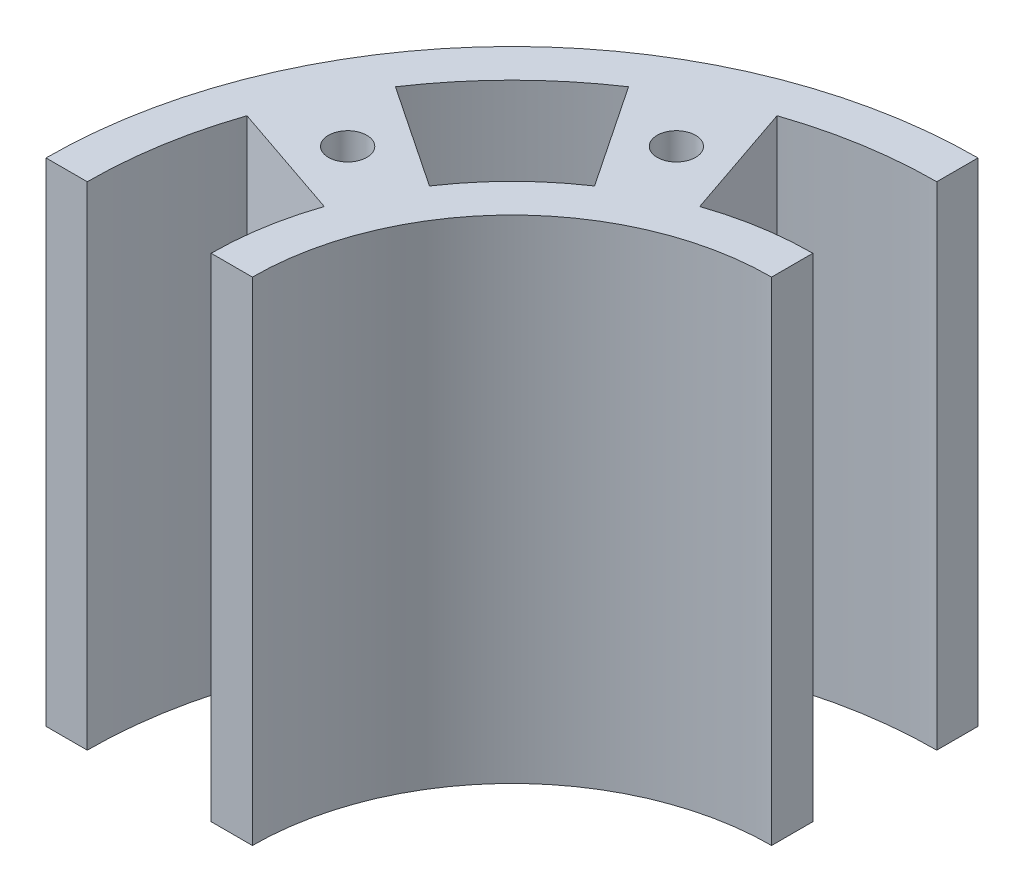
ISO-10303-21;
HEADER;
FILE_DESCRIPTION(('STEP AP214'),'2;1');
FILE_NAME('part.step','',(''),(''),'','','');
FILE_SCHEMA(('AUTOMOTIVE_DESIGN { 1 0 10303 214 1 1 1 1 }'));
ENDSEC;
DATA;
#1=APPLICATION_CONTEXT('core data for automotive mechanical design processes');
#2=APPLICATION_PROTOCOL_DEFINITION('international standard','automotive_design',2000,#1);
#3=PRODUCT_CONTEXT('',#1,'mechanical');
#4=PRODUCT('Part','Part','',(#3));
#5=PRODUCT_RELATED_PRODUCT_CATEGORY('part','',(#4));
#6=PRODUCT_DEFINITION_FORMATION('','',#4);
#7=PRODUCT_DEFINITION_CONTEXT('part definition',#1,'design');
#8=PRODUCT_DEFINITION('design','',#6,#7);
#9=PRODUCT_DEFINITION_SHAPE('','',#8);
#10=(LENGTH_UNIT() NAMED_UNIT(*) SI_UNIT(.MILLI.,.METRE.));
#11=(NAMED_UNIT(*) PLANE_ANGLE_UNIT() SI_UNIT($,.RADIAN.));
#12=(NAMED_UNIT(*) SI_UNIT($,.STERADIAN.) SOLID_ANGLE_UNIT());
#13=UNCERTAINTY_MEASURE_WITH_UNIT(LENGTH_MEASURE(1.E-05),#10,'distance_accuracy_value','');
#14=(GEOMETRIC_REPRESENTATION_CONTEXT(3) GLOBAL_UNCERTAINTY_ASSIGNED_CONTEXT((#13)) GLOBAL_UNIT_ASSIGNED_CONTEXT((#10,
#11,#12)) REPRESENTATION_CONTEXT('',''));
#15=CARTESIAN_POINT('',(0.,0.,0.));
#16=DIRECTION('',(0.,0.,1.));
#17=DIRECTION('',(1.,0.,0.));
#18=AXIS2_PLACEMENT_3D('',#15,#16,#17);
#19=CARTESIAN_POINT('',(60.,46.8,60.));
#20=DIRECTION('',(0.,-1.,0.));
#21=DIRECTION('',(0.,0.,-1.));
#22=AXIS2_PLACEMENT_3D('',#19,#20,#21);
#23=CYLINDRICAL_SURFACE('',#22,24.68);
#24=CARTESIAN_POINT('',(60.,0.,60.));
#25=DIRECTION('',(0.,1.,0.));
#26=DIRECTION('',(0.,0.,1.));
#27=AXIS2_PLACEMENT_3D('',#24,#25,#26);
#28=CIRCLE('',#27,24.68);
#29=CARTESIAN_POINT('',(60.,0.,35.32));
#30=VERTEX_POINT('',#29);
#31=CARTESIAN_POINT('',(35.32,0.,60.));
#32=VERTEX_POINT('',#31);
#33=EDGE_CURVE('E205',#30,#32,#28,.T.);
#34=ORIENTED_EDGE('',*,*,#33,.F.);
#35=DIRECTION('',(0.,-1.,0.));
#36=VECTOR('',#35,1.);
#37=CARTESIAN_POINT('',(60.,46.8,35.32));
#38=LINE('',#37,#36);
#39=CARTESIAN_POINT('',(60.,46.8,35.32));
#40=VERTEX_POINT('',#39);
#41=EDGE_CURVE('E11',#40,#30,#38,.T.);
#42=ORIENTED_EDGE('',*,*,#41,.F.);
#43=CARTESIAN_POINT('',(60.,46.8,60.));
#44=DIRECTION('',(0.,1.,0.));
#45=DIRECTION('',(0.,0.,1.));
#46=AXIS2_PLACEMENT_3D('',#43,#44,#45);
#47=CIRCLE('',#46,24.68);
#48=CARTESIAN_POINT('',(35.32,46.8,60.));
#49=VERTEX_POINT('',#48);
#50=EDGE_CURVE('E359',#40,#49,#47,.T.);
#51=ORIENTED_EDGE('',*,*,#50,.T.);
#52=DIRECTION('',(0.,-1.,0.));
#53=VECTOR('',#52,1.);
#54=CARTESIAN_POINT('',(35.32,46.8,60.));
#55=LINE('',#54,#53);
#56=EDGE_CURVE('E113',#49,#32,#55,.T.);
#57=ORIENTED_EDGE('',*,*,#56,.T.);
#58=EDGE_LOOP('',(#34,#42,#51,#57));
#59=FACE_BOUND('',#58,.T.);
#60=ADVANCED_FACE('F35',(#59),#23,.F.);
#61=CARTESIAN_POINT('',(60.,46.8,0.));
#62=DIRECTION('',(1.,0.,0.));
#63=DIRECTION('',(0.,0.,-1.));
#64=AXIS2_PLACEMENT_3D('',#61,#62,#63);
#65=PLANE('',#64);
#66=DIRECTION('',(0.,0.,1.));
#67=VECTOR('',#66,1.);
#68=CARTESIAN_POINT('',(60.,0.,0.));
#69=LINE('',#68,#67);
#70=CARTESIAN_POINT('',(60.,0.,31.4));
#71=VERTEX_POINT('',#70);
#72=EDGE_CURVE('E207',#71,#30,#69,.T.);
#73=ORIENTED_EDGE('',*,*,#72,.F.);
#74=DIRECTION('',(0.,-1.,0.));
#75=VECTOR('',#74,1.);
#76=CARTESIAN_POINT('',(60.,46.8,31.4));
#77=LINE('',#76,#75);
#78=CARTESIAN_POINT('',(60.,46.8,31.4));
#79=VERTEX_POINT('',#78);
#80=EDGE_CURVE('E45',#79,#71,#77,.T.);
#81=ORIENTED_EDGE('',*,*,#80,.F.);
#82=DIRECTION('',(0.,0.,1.));
#83=VECTOR('',#82,1.);
#84=CARTESIAN_POINT('',(60.,46.8,0.));
#85=LINE('',#84,#83);
#86=EDGE_CURVE('E358',#79,#40,#85,.T.);
#87=ORIENTED_EDGE('',*,*,#86,.T.);
#88=ORIENTED_EDGE('',*,*,#41,.T.);
#89=EDGE_LOOP('',(#73,#81,#87,#88));
#90=FACE_BOUND('',#89,.T.);
#91=ADVANCED_FACE('F293',(#90),#65,.T.);
#92=CARTESIAN_POINT('',(60.,46.8,60.));
#93=DIRECTION('',(0.,-1.,0.));
#94=DIRECTION('',(0.,0.,-1.));
#95=AXIS2_PLACEMENT_3D('',#92,#93,#94);
#96=CYLINDRICAL_SURFACE('',#95,28.6);
#97=CARTESIAN_POINT('',(60.,0.,60.));
#98=DIRECTION('',(0.,1.,0.));
#99=DIRECTION('',(0.,0.,1.));
#100=AXIS2_PLACEMENT_3D('',#97,#98,#99);
#101=CIRCLE('',#100,28.6);
#102=CARTESIAN_POINT('',(50.7743170530492,0.,32.9288571692597));
#103=VERTEX_POINT('',#102);
#104=EDGE_CURVE('E210',#71,#103,#101,.T.);
#105=ORIENTED_EDGE('',*,*,#104,.T.);
#106=DIRECTION('',(0.,-1.,0.));
#107=VECTOR('',#106,1.);
#108=CARTESIAN_POINT('',(50.7743170530492,46.8,32.9288571692597));
#109=LINE('',#108,#107);
#110=CARTESIAN_POINT('',(50.7743170530492,46.8,32.9288571692597));
#111=VERTEX_POINT('',#110);
#112=EDGE_CURVE('E253',#111,#103,#109,.T.);
#113=ORIENTED_EDGE('',*,*,#112,.F.);
#114=CARTESIAN_POINT('',(60.,46.8,60.));
#115=DIRECTION('',(0.,1.,0.));
#116=DIRECTION('',(0.,0.,1.));
#117=AXIS2_PLACEMENT_3D('',#114,#115,#116);
#118=CIRCLE('',#117,28.6);
#119=EDGE_CURVE('E363',#79,#111,#118,.T.);
#120=ORIENTED_EDGE('',*,*,#119,.F.);
#121=ORIENTED_EDGE('',*,*,#80,.T.);
#122=EDGE_LOOP('',(#105,#113,#120,#121));
#123=FACE_BOUND('',#122,.T.);
#124=ADVANCED_FACE('F298',(#123),#96,.T.);
#125=CARTESIAN_POINT('',(35.4367201374867,46.8,-12.0766214678252));
#126=DIRECTION('',(-0.946543455620289,0.,0.322576326816463));
#127=DIRECTION('',(0.322576326816463,0.,0.946543455620289));
#128=AXIS2_PLACEMENT_3D('',#125,#126,#127);
#129=PLANE('',#128);
#130=DIRECTION('',(-0.322576326816463,0.,-0.946543455620289));
#131=VECTOR('',#130,1.);
#132=CARTESIAN_POINT('',(35.4367201374867,0.,-12.0766214678252));
#133=LINE('',#132,#131);
#134=CARTESIAN_POINT('',(46.9743679231513,0.,21.7785752620527));
#135=VERTEX_POINT('',#134);
#136=EDGE_CURVE('E213',#103,#135,#133,.T.);
#137=ORIENTED_EDGE('',*,*,#136,.T.);
#138=DIRECTION('',(0.,-1.,0.));
#139=VECTOR('',#138,1.);
#140=CARTESIAN_POINT('',(46.9743679231513,46.8,21.7785752620527));
#141=LINE('',#140,#139);
#142=CARTESIAN_POINT('',(46.9743679231513,46.8,21.7785752620527));
#143=VERTEX_POINT('',#142);
#144=EDGE_CURVE('E251',#143,#135,#141,.T.);
#145=ORIENTED_EDGE('',*,*,#144,.F.);
#146=DIRECTION('',(-0.322576326816463,0.,-0.946543455620289));
#147=VECTOR('',#146,1.);
#148=CARTESIAN_POINT('',(35.4367201374867,46.8,-12.0766214678252));
#149=LINE('',#148,#147);
#150=EDGE_CURVE('E370',#111,#143,#149,.T.);
#151=ORIENTED_EDGE('',*,*,#150,.F.);
#152=ORIENTED_EDGE('',*,*,#112,.T.);
#153=EDGE_LOOP('',(#137,#145,#151,#152));
#154=FACE_BOUND('',#153,.T.);
#155=ADVANCED_FACE('F343',(#154),#129,.F.);
#156=CARTESIAN_POINT('',(60.,46.8,60.));
#157=DIRECTION('',(0.,-1.,0.));
#158=DIRECTION('',(0.,0.,-1.));
#159=AXIS2_PLACEMENT_3D('',#156,#157,#158);
#160=CYLINDRICAL_SURFACE('',#159,40.38);
#161=CARTESIAN_POINT('',(60.,0.,60.));
#162=DIRECTION('',(0.,1.,0.));
#163=DIRECTION('',(0.,0.,1.));
#164=AXIS2_PLACEMENT_3D('',#161,#162,#163);
#165=CIRCLE('',#164,40.38);
#166=CARTESIAN_POINT('',(60.,0.,19.62));
#167=VERTEX_POINT('',#166);
#168=EDGE_CURVE('E216',#167,#135,#165,.T.);
#169=ORIENTED_EDGE('',*,*,#168,.F.);
#170=DIRECTION('',(0.,-1.,0.));
#171=VECTOR('',#170,1.);
#172=CARTESIAN_POINT('',(60.,46.8,19.62));
#173=LINE('',#172,#171);
#174=CARTESIAN_POINT('',(60.,46.8,19.62));
#175=VERTEX_POINT('',#174);
#176=EDGE_CURVE('E249',#175,#167,#173,.T.);
#177=ORIENTED_EDGE('',*,*,#176,.F.);
#178=CARTESIAN_POINT('',(60.,46.8,60.));
#179=DIRECTION('',(0.,1.,0.));
#180=DIRECTION('',(0.,0.,1.));
#181=AXIS2_PLACEMENT_3D('',#178,#179,#180);
#182=CIRCLE('',#181,40.38);
#183=EDGE_CURVE('E372',#175,#143,#182,.T.);
#184=ORIENTED_EDGE('',*,*,#183,.T.);
#185=ORIENTED_EDGE('',*,*,#144,.T.);
#186=EDGE_LOOP('',(#169,#177,#184,#185));
#187=FACE_BOUND('',#186,.T.);
#188=ADVANCED_FACE('F339',(#187),#160,.F.);
#189=CARTESIAN_POINT('',(60.,46.8,0.));
#190=DIRECTION('',(1.,0.,0.));
#191=DIRECTION('',(0.,0.,-1.));
#192=AXIS2_PLACEMENT_3D('',#189,#190,#191);
#193=PLANE('',#192);
#194=DIRECTION('',(0.,0.,1.));
#195=VECTOR('',#194,1.);
#196=CARTESIAN_POINT('',(60.,0.,0.));
#197=LINE('',#196,#195);
#198=CARTESIAN_POINT('',(60.,0.,15.7));
#199=VERTEX_POINT('',#198);
#200=EDGE_CURVE('E219',#199,#167,#197,.T.);
#201=ORIENTED_EDGE('',*,*,#200,.F.);
#202=DIRECTION('',(0.,-1.,0.));
#203=VECTOR('',#202,1.);
#204=CARTESIAN_POINT('',(60.,46.8,15.7));
#205=LINE('',#204,#203);
#206=CARTESIAN_POINT('',(60.,46.8,15.7));
#207=VERTEX_POINT('',#206);
#208=EDGE_CURVE('E247',#207,#199,#205,.T.);
#209=ORIENTED_EDGE('',*,*,#208,.F.);
#210=DIRECTION('',(0.,0.,1.));
#211=VECTOR('',#210,1.);
#212=CARTESIAN_POINT('',(60.,46.8,0.));
#213=LINE('',#212,#211);
#214=EDGE_CURVE('E375',#207,#175,#213,.T.);
#215=ORIENTED_EDGE('',*,*,#214,.T.);
#216=ORIENTED_EDGE('',*,*,#176,.T.);
#217=EDGE_LOOP('',(#201,#209,#215,#216));
#218=FACE_BOUND('',#217,.T.);
#219=ADVANCED_FACE('F335',(#218),#193,.T.);
#220=CARTESIAN_POINT('',(60.,46.8,60.));
#221=DIRECTION('',(0.,-1.,0.));
#222=DIRECTION('',(0.,0.,-1.));
#223=AXIS2_PLACEMENT_3D('',#220,#221,#222);
#224=CYLINDRICAL_SURFACE('',#223,44.3);
#225=CARTESIAN_POINT('',(60.,0.,60.));
#226=DIRECTION('',(0.,1.,0.));
#227=DIRECTION('',(0.,0.,1.));
#228=AXIS2_PLACEMENT_3D('',#225,#226,#227);
#229=CIRCLE('',#228,44.3);
#230=CARTESIAN_POINT('',(15.7,0.,60.));
#231=VERTEX_POINT('',#230);
#232=EDGE_CURVE('E222',#199,#231,#229,.T.);
#233=ORIENTED_EDGE('',*,*,#232,.T.);
#234=DIRECTION('',(0.,-1.,0.));
#235=VECTOR('',#234,1.);
#236=CARTESIAN_POINT('',(15.7,46.8,60.));
#237=LINE('',#236,#235);
#238=CARTESIAN_POINT('',(15.7,46.8,60.));
#239=VERTEX_POINT('',#238);
#240=EDGE_CURVE('E244',#239,#231,#237,.T.);
#241=ORIENTED_EDGE('',*,*,#240,.F.);
#242=CARTESIAN_POINT('',(60.,46.8,60.));
#243=DIRECTION('',(0.,1.,0.));
#244=DIRECTION('',(0.,0.,1.));
#245=AXIS2_PLACEMENT_3D('',#242,#243,#244);
#246=CIRCLE('',#245,44.3);
#247=EDGE_CURVE('E378',#207,#239,#246,.T.);
#248=ORIENTED_EDGE('',*,*,#247,.F.);
#249=ORIENTED_EDGE('',*,*,#208,.T.);
#250=EDGE_LOOP('',(#233,#241,#248,#249));
#251=FACE_BOUND('',#250,.T.);
#252=ADVANCED_FACE('F331',(#251),#224,.T.);
#253=CARTESIAN_POINT('',(0.,46.8,60.));
#254=DIRECTION('',(0.,0.,-1.));
#255=DIRECTION('',(-1.,0.,0.));
#256=AXIS2_PLACEMENT_3D('',#253,#254,#255);
#257=PLANE('',#256);
#258=DIRECTION('',(1.,0.,0.));
#259=VECTOR('',#258,1.);
#260=CARTESIAN_POINT('',(0.,0.,60.));
#261=LINE('',#260,#259);
#262=CARTESIAN_POINT('',(19.62,0.,60.));
#263=VERTEX_POINT('',#262);
#264=EDGE_CURVE('E225',#231,#263,#261,.T.);
#265=ORIENTED_EDGE('',*,*,#264,.T.);
#266=DIRECTION('',(0.,-1.,0.));
#267=VECTOR('',#266,1.);
#268=CARTESIAN_POINT('',(19.62,46.8,60.));
#269=LINE('',#268,#267);
#270=CARTESIAN_POINT('',(19.62,46.8,60.));
#271=VERTEX_POINT('',#270);
#272=EDGE_CURVE('E242',#271,#263,#269,.T.);
#273=ORIENTED_EDGE('',*,*,#272,.F.);
#274=DIRECTION('',(1.,0.,0.));
#275=VECTOR('',#274,1.);
#276=CARTESIAN_POINT('',(0.,46.8,60.));
#277=LINE('',#276,#275);
#278=EDGE_CURVE('E182',#239,#271,#277,.T.);
#279=ORIENTED_EDGE('',*,*,#278,.F.);
#280=ORIENTED_EDGE('',*,*,#240,.T.);
#281=EDGE_LOOP('',(#265,#273,#279,#280));
#282=FACE_BOUND('',#281,.T.);
#283=ADVANCED_FACE('F327',(#282),#257,.F.);
#284=CARTESIAN_POINT('',(60.,46.8,60.));
#285=DIRECTION('',(0.,-1.,0.));
#286=DIRECTION('',(0.,0.,-1.));
#287=AXIS2_PLACEMENT_3D('',#284,#285,#286);
#288=CYLINDRICAL_SURFACE('',#287,40.38);
#289=CARTESIAN_POINT('',(60.,0.,60.));
#290=DIRECTION('',(0.,1.,0.));
#291=DIRECTION('',(0.,0.,1.));
#292=AXIS2_PLACEMENT_3D('',#289,#290,#291);
#293=CIRCLE('',#292,40.38);
#294=CARTESIAN_POINT('',(21.7785752620527,0.,46.9743679231513));
#295=VERTEX_POINT('',#294);
#296=EDGE_CURVE('E228',#295,#263,#293,.T.);
#297=ORIENTED_EDGE('',*,*,#296,.F.);
#298=DIRECTION('',(0.,-1.,0.));
#299=VECTOR('',#298,1.);
#300=CARTESIAN_POINT('',(21.7785752620527,46.8,46.9743679231513));
#301=LINE('',#300,#299);
#302=CARTESIAN_POINT('',(21.7785752620527,46.8,46.9743679231513));
#303=VERTEX_POINT('',#302);
#304=EDGE_CURVE('E169',#303,#295,#301,.T.);
#305=ORIENTED_EDGE('',*,*,#304,.F.);
#306=CARTESIAN_POINT('',(60.,46.8,60.));
#307=DIRECTION('',(0.,1.,0.));
#308=DIRECTION('',(0.,0.,1.));
#309=AXIS2_PLACEMENT_3D('',#306,#307,#308);
#310=CIRCLE('',#309,40.38);
#311=EDGE_CURVE('E180',#303,#271,#310,.T.);
#312=ORIENTED_EDGE('',*,*,#311,.T.);
#313=ORIENTED_EDGE('',*,*,#272,.T.);
#314=EDGE_LOOP('',(#297,#305,#312,#313));
#315=FACE_BOUND('',#314,.T.);
#316=ADVANCED_FACE('F324',(#315),#288,.F.);
#317=CARTESIAN_POINT('',(-12.0766214678252,46.8,35.4367201374867));
#318=DIRECTION('',(-0.322576326816462,0.,0.94654345562029));
#319=DIRECTION('',(0.94654345562029,0.,0.322576326816462));
#320=AXIS2_PLACEMENT_3D('',#317,#318,#319);
#321=PLANE('',#320);
#322=DIRECTION('',(-0.94654345562029,0.,-0.322576326816462));
#323=VECTOR('',#322,1.);
#324=CARTESIAN_POINT('',(-12.0766214678252,0.,35.4367201374867));
#325=LINE('',#324,#323);
#326=CARTESIAN_POINT('',(32.9288571692597,0.,50.7743170530492));
#327=VERTEX_POINT('',#326);
#328=EDGE_CURVE('E166',#327,#295,#325,.T.);
#329=ORIENTED_EDGE('',*,*,#328,.F.);
#330=DIRECTION('',(0.,-1.,0.));
#331=VECTOR('',#330,1.);
#332=CARTESIAN_POINT('',(32.9288571692597,46.8,50.7743170530492));
#333=LINE('',#332,#331);
#334=CARTESIAN_POINT('',(32.9288571692597,46.8,50.7743170530492));
#335=VERTEX_POINT('',#334);
#336=EDGE_CURVE('E160',#335,#327,#333,.T.);
#337=ORIENTED_EDGE('',*,*,#336,.F.);
#338=DIRECTION('',(-0.94654345562029,0.,-0.322576326816462));
#339=VECTOR('',#338,1.);
#340=CARTESIAN_POINT('',(-12.0766214678252,46.8,35.4367201374867));
#341=LINE('',#340,#339);
#342=EDGE_CURVE('E164',#335,#303,#341,.T.);
#343=ORIENTED_EDGE('',*,*,#342,.T.);
#344=ORIENTED_EDGE('',*,*,#304,.T.);
#345=EDGE_LOOP('',(#329,#337,#343,#344));
#346=FACE_BOUND('',#345,.T.);
#347=ADVANCED_FACE('F162',(#346),#321,.T.);
#348=CARTESIAN_POINT('',(60.,46.8,60.));
#349=DIRECTION('',(0.,-1.,0.));
#350=DIRECTION('',(0.,0.,-1.));
#351=AXIS2_PLACEMENT_3D('',#348,#349,#350);
#352=CYLINDRICAL_SURFACE('',#351,28.6);
#353=CARTESIAN_POINT('',(60.,0.,60.));
#354=DIRECTION('',(0.,1.,0.));
#355=DIRECTION('',(0.,0.,1.));
#356=AXIS2_PLACEMENT_3D('',#353,#354,#355);
#357=CIRCLE('',#356,28.6);
#358=CARTESIAN_POINT('',(31.4,0.,60.));
#359=VERTEX_POINT('',#358);
#360=EDGE_CURVE('E232',#327,#359,#357,.T.);
#361=ORIENTED_EDGE('',*,*,#360,.T.);
#362=DIRECTION('',(0.,-1.,0.));
#363=VECTOR('',#362,1.);
#364=CARTESIAN_POINT('',(31.4,46.8,60.));
#365=LINE('',#364,#363);
#366=CARTESIAN_POINT('',(31.4,46.8,60.));
#367=VERTEX_POINT('',#366);
#368=EDGE_CURVE('E170',#367,#359,#365,.T.);
#369=ORIENTED_EDGE('',*,*,#368,.F.);
#370=CARTESIAN_POINT('',(60.,46.8,60.));
#371=DIRECTION('',(0.,1.,0.));
#372=DIRECTION('',(0.,0.,1.));
#373=AXIS2_PLACEMENT_3D('',#370,#371,#372);
#374=CIRCLE('',#373,28.6);
#375=EDGE_CURVE('E173',#335,#367,#374,.T.);
#376=ORIENTED_EDGE('',*,*,#375,.F.);
#377=ORIENTED_EDGE('',*,*,#336,.T.);
#378=EDGE_LOOP('',(#361,#369,#376,#377));
#379=FACE_BOUND('',#378,.T.);
#380=ADVANCED_FACE('F174',(#379),#352,.T.);
#381=CARTESIAN_POINT('',(13.678493894277,46.8,-9.16131303264548));
#382=DIRECTION('',(-0.830862036917695,0.,0.556478459249753));
#383=DIRECTION('',(0.556478459249753,0.,0.830862036917695));
#384=AXIS2_PLACEMENT_3D('',#381,#382,#383);
#385=PLANE('',#384);
#386=DIRECTION('',(-0.556478459249753,0.,-0.830862036917695));
#387=VECTOR('',#386,1.);
#388=CARTESIAN_POINT('',(13.678493894277,0.,-9.16131303264548));
#389=LINE('',#388,#387);
#390=CARTESIAN_POINT('',(44.0847160654571,0.,36.2373457441539));
#391=VERTEX_POINT('',#390);
#392=CARTESIAN_POINT('',(37.529399815495,0.,26.4497909492635));
#393=VERTEX_POINT('',#392);
#394=EDGE_CURVE('E191',#391,#393,#389,.T.);
#395=ORIENTED_EDGE('',*,*,#394,.F.);
#396=DIRECTION('',(0.,-1.,0.));
#397=VECTOR('',#396,1.);
#398=CARTESIAN_POINT('',(44.0847160654571,46.8,36.2373457441539));
#399=LINE('',#398,#397);
#400=CARTESIAN_POINT('',(44.0847160654571,46.8,36.2373457441539));
#401=VERTEX_POINT('',#400);
#402=EDGE_CURVE('E39',#401,#391,#399,.T.);
#403=ORIENTED_EDGE('',*,*,#402,.F.);
#404=DIRECTION('',(-0.556478459249753,0.,-0.830862036917695));
#405=VECTOR('',#404,1.);
#406=CARTESIAN_POINT('',(13.678493894277,46.8,-9.16131303264548));
#407=LINE('',#406,#405);
#408=CARTESIAN_POINT('',(37.529399815495,46.8,26.4497909492635));
#409=VERTEX_POINT('',#408);
#410=EDGE_CURVE('E238',#401,#409,#407,.T.);
#411=ORIENTED_EDGE('',*,*,#410,.T.);
#412=DIRECTION('',(0.,-1.,0.));
#413=VECTOR('',#412,1.);
#414=CARTESIAN_POINT('',(37.529399815495,46.8,26.4497909492635));
#415=LINE('',#414,#413);
#416=EDGE_CURVE('E190',#409,#393,#415,.T.);
#417=ORIENTED_EDGE('',*,*,#416,.T.);
#418=EDGE_LOOP('',(#395,#403,#411,#417));
#419=FACE_BOUND('',#418,.T.);
#420=ADVANCED_FACE('F37',(#419),#385,.T.);
#421=CARTESIAN_POINT('',(60.,46.8,60.));
#422=DIRECTION('',(0.,-1.,0.));
#423=DIRECTION('',(0.,0.,-1.));
#424=AXIS2_PLACEMENT_3D('',#421,#422,#423);
#425=CYLINDRICAL_SURFACE('',#424,28.6);
#426=CARTESIAN_POINT('',(60.,0.,60.));
#427=DIRECTION('',(0.,1.,0.));
#428=DIRECTION('',(0.,0.,1.));
#429=AXIS2_PLACEMENT_3D('',#426,#427,#428);
#430=CIRCLE('',#429,28.6);
#431=CARTESIAN_POINT('',(36.2373457441539,0.,44.0847160654571));
#432=VERTEX_POINT('',#431);
#433=EDGE_CURVE('E194',#391,#432,#430,.T.);
#434=ORIENTED_EDGE('',*,*,#433,.T.);
#435=DIRECTION('',(0.,-1.,0.));
#436=VECTOR('',#435,1.);
#437=CARTESIAN_POINT('',(36.2373457441539,46.8,44.0847160654571));
#438=LINE('',#437,#436);
#439=CARTESIAN_POINT('',(36.2373457441539,46.8,44.0847160654571));
#440=VERTEX_POINT('',#439);
#441=EDGE_CURVE('E259',#440,#432,#438,.T.);
#442=ORIENTED_EDGE('',*,*,#441,.F.);
#443=CARTESIAN_POINT('',(60.,46.8,60.));
#444=DIRECTION('',(0.,1.,0.));
#445=DIRECTION('',(0.,0.,1.));
#446=AXIS2_PLACEMENT_3D('',#443,#444,#445);
#447=CIRCLE('',#446,28.6);
#448=EDGE_CURVE('E268',#401,#440,#447,.T.);
#449=ORIENTED_EDGE('',*,*,#448,.F.);
#450=ORIENTED_EDGE('',*,*,#402,.T.);
#451=EDGE_LOOP('',(#434,#442,#449,#450));
#452=FACE_BOUND('',#451,.T.);
#453=ADVANCED_FACE('F267',(#452),#425,.T.);
#454=CARTESIAN_POINT('',(-9.1613130326455,46.8,13.6784938942771));
#455=DIRECTION('',(-0.556478459249752,0.,0.830862036917695));
#456=DIRECTION('',(0.830862036917695,0.,0.556478459249752));
#457=AXIS2_PLACEMENT_3D('',#454,#455,#456);
#458=PLANE('',#457);
#459=DIRECTION('',(-0.830862036917695,0.,-0.556478459249752));
#460=VECTOR('',#459,1.);
#461=CARTESIAN_POINT('',(-9.1613130326455,0.,13.6784938942771));
#462=LINE('',#461,#460);
#463=CARTESIAN_POINT('',(26.4497909492635,0.,37.529399815495));
#464=VERTEX_POINT('',#463);
#465=EDGE_CURVE('E196',#432,#464,#462,.T.);
#466=ORIENTED_EDGE('',*,*,#465,.T.);
#467=DIRECTION('',(0.,-1.,0.));
#468=VECTOR('',#467,1.);
#469=CARTESIAN_POINT('',(26.4497909492635,46.8,37.529399815495));
#470=LINE('',#469,#468);
#471=CARTESIAN_POINT('',(26.4497909492635,46.8,37.529399815495));
#472=VERTEX_POINT('',#471);
#473=EDGE_CURVE('E258',#472,#464,#470,.T.);
#474=ORIENTED_EDGE('',*,*,#473,.F.);
#475=DIRECTION('',(-0.830862036917695,0.,-0.556478459249752));
#476=VECTOR('',#475,1.);
#477=CARTESIAN_POINT('',(-9.1613130326455,46.8,13.6784938942771));
#478=LINE('',#477,#476);
#479=EDGE_CURVE('E391',#440,#472,#478,.T.);
#480=ORIENTED_EDGE('',*,*,#479,.F.);
#481=ORIENTED_EDGE('',*,*,#441,.T.);
#482=EDGE_LOOP('',(#466,#474,#480,#481));
#483=FACE_BOUND('',#482,.T.);
#484=ADVANCED_FACE('F280',(#483),#458,.F.);
#485=CARTESIAN_POINT('',(0.,46.8,60.));
#486=DIRECTION('',(0.,0.,-1.));
#487=DIRECTION('',(-1.,0.,0.));
#488=AXIS2_PLACEMENT_3D('',#485,#486,#487);
#489=PLANE('',#488);
#490=DIRECTION('',(1.,0.,0.));
#491=VECTOR('',#490,1.);
#492=CARTESIAN_POINT('',(0.,0.,60.));
#493=LINE('',#492,#491);
#494=EDGE_CURVE('E106',#359,#32,#493,.T.);
#495=ORIENTED_EDGE('',*,*,#494,.T.);
#496=ORIENTED_EDGE('',*,*,#56,.F.);
#497=DIRECTION('',(1.,0.,0.));
#498=VECTOR('',#497,1.);
#499=CARTESIAN_POINT('',(0.,46.8,60.));
#500=LINE('',#499,#498);
#501=EDGE_CURVE('E54',#367,#49,#500,.T.);
#502=ORIENTED_EDGE('',*,*,#501,.F.);
#503=ORIENTED_EDGE('',*,*,#368,.T.);
#504=EDGE_LOOP('',(#495,#496,#502,#503));
#505=FACE_BOUND('',#504,.T.);
#506=ADVANCED_FACE('F282',(#505),#489,.F.);
#507=CARTESIAN_POINT('',(29.0843728836047,46.8,44.71));
#508=DIRECTION('',(0.,-1.,0.));
#509=DIRECTION('',(0.,0.,-1.));
#510=AXIS2_PLACEMENT_3D('',#507,#508,#509);
#511=CYLINDRICAL_SURFACE('',#510,1.82500000000001);
#512=CARTESIAN_POINT('',(29.0843728836047,46.8,44.71));
#513=DIRECTION('',(0.,1.,0.));
#514=DIRECTION('',(0.,0.,1.));
#515=AXIS2_PLACEMENT_3D('',#512,#513,#514);
#516=CIRCLE('',#515,1.82500000000001);
#517=CARTESIAN_POINT('',(29.0843728836047,46.8,46.535));
#518=VERTEX_POINT('',#517);
#519=EDGE_CURVE('E361',#518,#518,#516,.F.);
#520=ORIENTED_EDGE('',*,*,#519,.F.);
#521=EDGE_LOOP('',(#520));
#522=FACE_BOUND('',#521,.T.);
#523=CARTESIAN_POINT('',(29.0843728836047,0.,44.71));
#524=DIRECTION('',(0.,1.,0.));
#525=DIRECTION('',(0.,0.,1.));
#526=AXIS2_PLACEMENT_3D('',#523,#524,#525);
#527=CIRCLE('',#526,1.82500000000001);
#528=CARTESIAN_POINT('',(29.0843728836047,0.,46.535));
#529=VERTEX_POINT('',#528);
#530=EDGE_CURVE('E202',#529,#529,#527,.F.);
#531=ORIENTED_EDGE('',*,*,#530,.T.);
#532=EDGE_LOOP('',(#531));
#533=FACE_BOUND('',#532,.T.);
#534=ADVANCED_FACE('F288',(#522,#533),#511,.F.);
#535=CARTESIAN_POINT('',(60.,46.8,60.));
#536=DIRECTION('',(0.,-1.,0.));
#537=DIRECTION('',(0.,0.,-1.));
#538=AXIS2_PLACEMENT_3D('',#535,#536,#537);
#539=CYLINDRICAL_SURFACE('',#538,40.38);
#540=CARTESIAN_POINT('',(60.,0.,60.));
#541=DIRECTION('',(0.,1.,0.));
#542=DIRECTION('',(0.,0.,1.));
#543=AXIS2_PLACEMENT_3D('',#540,#541,#542);
#544=CIRCLE('',#543,40.38);
#545=EDGE_CURVE('E199',#393,#464,#544,.T.);
#546=ORIENTED_EDGE('',*,*,#545,.F.);
#547=ORIENTED_EDGE('',*,*,#416,.F.);
#548=CARTESIAN_POINT('',(60.,46.8,60.));
#549=DIRECTION('',(0.,1.,0.));
#550=DIRECTION('',(0.,0.,1.));
#551=AXIS2_PLACEMENT_3D('',#548,#549,#550);
#552=CIRCLE('',#551,40.38);
#553=EDGE_CURVE('E278',#409,#472,#552,.T.);
#554=ORIENTED_EDGE('',*,*,#553,.T.);
#555=ORIENTED_EDGE('',*,*,#473,.T.);
#556=EDGE_LOOP('',(#546,#547,#554,#555));
#557=FACE_BOUND('',#556,.T.);
#558=ADVANCED_FACE('F277',(#557),#539,.F.);
#559=CARTESIAN_POINT('',(44.71,46.8,29.0843728836047));
#560=DIRECTION('',(0.,-1.,0.));
#561=DIRECTION('',(0.,0.,-1.));
#562=AXIS2_PLACEMENT_3D('',#559,#560,#561);
#563=CYLINDRICAL_SURFACE('',#562,1.825);
#564=CARTESIAN_POINT('',(44.71,46.8,29.0843728836047));
#565=DIRECTION('',(0.,1.,0.));
#566=DIRECTION('',(0.,0.,1.));
#567=AXIS2_PLACEMENT_3D('',#564,#565,#566);
#568=CIRCLE('',#567,1.825);
#569=CARTESIAN_POINT('',(44.71,46.8,30.9093728836047));
#570=VERTEX_POINT('',#569);
#571=EDGE_CURVE('E187',#570,#570,#568,.T.);
#572=ORIENTED_EDGE('',*,*,#571,.T.);
#573=EDGE_LOOP('',(#572));
#574=FACE_BOUND('',#573,.T.);
#575=CARTESIAN_POINT('',(44.71,0.,29.0843728836047));
#576=DIRECTION('',(0.,1.,0.));
#577=DIRECTION('',(0.,0.,1.));
#578=AXIS2_PLACEMENT_3D('',#575,#576,#577);
#579=CIRCLE('',#578,1.825);
#580=CARTESIAN_POINT('',(44.71,0.,30.9093728836047));
#581=VERTEX_POINT('',#580);
#582=EDGE_CURVE('E235',#581,#581,#579,.T.);
#583=ORIENTED_EDGE('',*,*,#582,.F.);
#584=EDGE_LOOP('',(#583));
#585=FACE_BOUND('',#584,.T.);
#586=ADVANCED_FACE('F306',(#574,#585),#563,.F.);
#587=CARTESIAN_POINT('',(0.,46.8,0.));
#588=DIRECTION('',(0.,1.,0.));
#589=DIRECTION('',(0.,0.,1.));
#590=AXIS2_PLACEMENT_3D('',#587,#588,#589);
#591=PLANE('',#590);
#592=ORIENTED_EDGE('',*,*,#410,.F.);
#593=ORIENTED_EDGE('',*,*,#448,.T.);
#594=ORIENTED_EDGE('',*,*,#479,.T.);
#595=ORIENTED_EDGE('',*,*,#553,.F.);
#596=EDGE_LOOP('',(#592,#593,#594,#595));
#597=FACE_BOUND('',#596,.T.);
#598=ORIENTED_EDGE('',*,*,#519,.T.);
#599=EDGE_LOOP('',(#598));
#600=FACE_BOUND('',#599,.T.);
#601=ORIENTED_EDGE('',*,*,#50,.F.);
#602=ORIENTED_EDGE('',*,*,#86,.F.);
#603=ORIENTED_EDGE('',*,*,#119,.T.);
#604=ORIENTED_EDGE('',*,*,#150,.T.);
#605=ORIENTED_EDGE('',*,*,#183,.F.);
#606=ORIENTED_EDGE('',*,*,#214,.F.);
#607=ORIENTED_EDGE('',*,*,#247,.T.);
#608=ORIENTED_EDGE('',*,*,#278,.T.);
#609=ORIENTED_EDGE('',*,*,#311,.F.);
#610=ORIENTED_EDGE('',*,*,#342,.F.);
#611=ORIENTED_EDGE('',*,*,#375,.T.);
#612=ORIENTED_EDGE('',*,*,#501,.T.);
#613=EDGE_LOOP('',(#601,#602,#603,#604,#605,#606,#607,#608,#609,#610,#611,#612));
#614=FACE_BOUND('',#613,.T.);
#615=ORIENTED_EDGE('',*,*,#571,.F.);
#616=EDGE_LOOP('',(#615));
#617=FACE_BOUND('',#616,.T.);
#618=ADVANCED_FACE('F177',(#597,#600,#614,#617),#591,.T.);
#619=CARTESIAN_POINT('',(0.,0.,0.));
#620=DIRECTION('',(0.,1.,0.));
#621=DIRECTION('',(0.,0.,1.));
#622=AXIS2_PLACEMENT_3D('',#619,#620,#621);
#623=PLANE('',#622);
#624=ORIENTED_EDGE('',*,*,#394,.T.);
#625=ORIENTED_EDGE('',*,*,#545,.T.);
#626=ORIENTED_EDGE('',*,*,#465,.F.);
#627=ORIENTED_EDGE('',*,*,#433,.F.);
#628=EDGE_LOOP('',(#624,#625,#626,#627));
#629=FACE_BOUND('',#628,.T.);
#630=ORIENTED_EDGE('',*,*,#530,.F.);
#631=EDGE_LOOP('',(#630));
#632=FACE_BOUND('',#631,.T.);
#633=ORIENTED_EDGE('',*,*,#33,.T.);
#634=ORIENTED_EDGE('',*,*,#494,.F.);
#635=ORIENTED_EDGE('',*,*,#360,.F.);
#636=ORIENTED_EDGE('',*,*,#328,.T.);
#637=ORIENTED_EDGE('',*,*,#296,.T.);
#638=ORIENTED_EDGE('',*,*,#264,.F.);
#639=ORIENTED_EDGE('',*,*,#232,.F.);
#640=ORIENTED_EDGE('',*,*,#200,.T.);
#641=ORIENTED_EDGE('',*,*,#168,.T.);
#642=ORIENTED_EDGE('',*,*,#136,.F.);
#643=ORIENTED_EDGE('',*,*,#104,.F.);
#644=ORIENTED_EDGE('',*,*,#72,.T.);
#645=EDGE_LOOP('',(#633,#634,#635,#636,#637,#638,#639,#640,#641,#642,#643,#644));
#646=FACE_BOUND('',#645,.T.);
#647=ORIENTED_EDGE('',*,*,#582,.T.);
#648=EDGE_LOOP('',(#647));
#649=FACE_BOUND('',#648,.T.);
#650=ADVANCED_FACE('F271',(#629,#632,#646,#649),#623,.F.);
#651=CLOSED_SHELL('',(#60,#91,#124,#155,#188,#219,#252,#283,#316,#347,#380,#420,#453,#484,#506,
#534,#558,#586,#618,#650));
#652=MANIFOLD_SOLID_BREP('B2',#651);
#653=ADVANCED_BREP_SHAPE_REPRESENTATION('',(#18,#652),#14);
#654=SHAPE_DEFINITION_REPRESENTATION(#9,#653);
ENDSEC;
END-ISO-10303-21;
